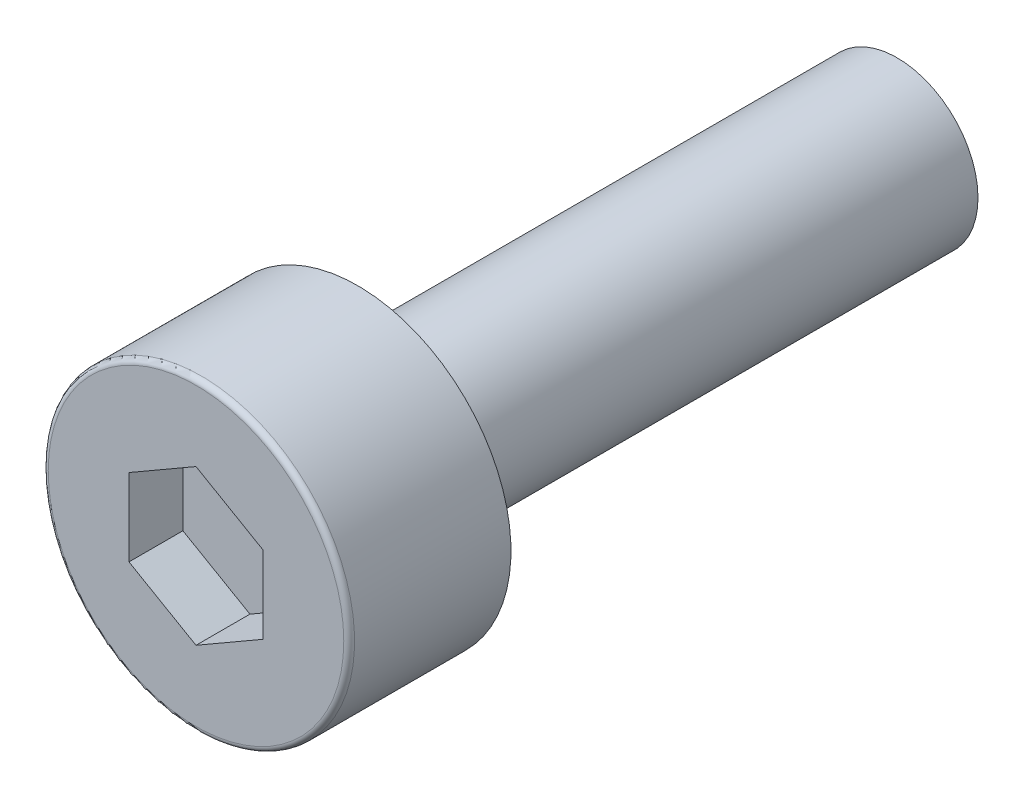
ISO-10303-21;
HEADER;
FILE_DESCRIPTION(('STEP AP214'),'2;1');
FILE_NAME('part.step','',(''),(''),'','','');
FILE_SCHEMA(('AUTOMOTIVE_DESIGN { 1 0 10303 214 1 1 1 1 }'));
ENDSEC;
DATA;
#1=APPLICATION_CONTEXT('core data for automotive mechanical design processes');
#2=APPLICATION_PROTOCOL_DEFINITION('international standard','automotive_design',2000,#1);
#3=PRODUCT_CONTEXT('',#1,'mechanical');
#4=PRODUCT('Part','Part','',(#3));
#5=PRODUCT_RELATED_PRODUCT_CATEGORY('part','',(#4));
#6=PRODUCT_DEFINITION_FORMATION('','',#4);
#7=PRODUCT_DEFINITION_CONTEXT('part definition',#1,'design');
#8=PRODUCT_DEFINITION('design','',#6,#7);
#9=PRODUCT_DEFINITION_SHAPE('','',#8);
#10=(LENGTH_UNIT() NAMED_UNIT(*) SI_UNIT(.MILLI.,.METRE.));
#11=(NAMED_UNIT(*) PLANE_ANGLE_UNIT() SI_UNIT($,.RADIAN.));
#12=(NAMED_UNIT(*) SI_UNIT($,.STERADIAN.) SOLID_ANGLE_UNIT());
#13=UNCERTAINTY_MEASURE_WITH_UNIT(LENGTH_MEASURE(1.E-05),#10,'distance_accuracy_value','');
#14=(GEOMETRIC_REPRESENTATION_CONTEXT(3) GLOBAL_UNCERTAINTY_ASSIGNED_CONTEXT((#13)) GLOBAL_UNIT_ASSIGNED_CONTEXT((#10,
#11,#12)) REPRESENTATION_CONTEXT('',''));
#15=CARTESIAN_POINT('',(0.,0.,0.));
#16=DIRECTION('',(0.,0.,1.));
#17=DIRECTION('',(1.,0.,0.));
#18=AXIS2_PLACEMENT_3D('',#15,#16,#17);
#19=CARTESIAN_POINT('',(0.,0.,2.));
#20=DIRECTION('',(0.,0.,1.));
#21=DIRECTION('',(1.,0.,0.));
#22=AXIS2_PLACEMENT_3D('',#19,#20,#21);
#23=PLANE('',#22);
#24=DIRECTION('',(-0.866025403784439,-0.5,0.));
#25=VECTOR('',#24,1.);
#26=CARTESIAN_POINT('',(0.,1.435,2.));
#27=LINE('',#26,#25);
#28=CARTESIAN_POINT('',(0.,1.435,2.));
#29=VERTEX_POINT('',#28);
#30=CARTESIAN_POINT('',(-1.24274645443067,0.7175,2.));
#31=VERTEX_POINT('',#30);
#32=EDGE_CURVE('E61',#29,#31,#27,.T.);
#33=ORIENTED_EDGE('',*,*,#32,.T.);
#34=DIRECTION('',(0.,-1.,0.));
#35=VECTOR('',#34,1.);
#36=CARTESIAN_POINT('',(-1.24274645443067,0.7175,2.));
#37=LINE('',#36,#35);
#38=CARTESIAN_POINT('',(-1.24274645443067,-0.7175,2.));
#39=VERTEX_POINT('',#38);
#40=EDGE_CURVE('E63',#31,#39,#37,.T.);
#41=ORIENTED_EDGE('',*,*,#40,.T.);
#42=DIRECTION('',(0.866025403784439,-0.5,0.));
#43=VECTOR('',#42,1.);
#44=CARTESIAN_POINT('',(-1.24274645443067,-0.7175,2.));
#45=LINE('',#44,#43);
#46=CARTESIAN_POINT('',(0.,-1.435,2.));
#47=VERTEX_POINT('',#46);
#48=EDGE_CURVE('E65',#39,#47,#45,.T.);
#49=ORIENTED_EDGE('',*,*,#48,.T.);
#50=DIRECTION('',(0.866025403784439,0.5,0.));
#51=VECTOR('',#50,1.);
#52=CARTESIAN_POINT('',(0.,-1.435,2.));
#53=LINE('',#52,#51);
#54=CARTESIAN_POINT('',(1.24274645443067,-0.717500000000001,2.));
#55=VERTEX_POINT('',#54);
#56=EDGE_CURVE('E134',#47,#55,#53,.T.);
#57=ORIENTED_EDGE('',*,*,#56,.T.);
#58=DIRECTION('',(0.,1.,0.));
#59=VECTOR('',#58,1.);
#60=CARTESIAN_POINT('',(1.24274645443067,-0.7175,2.));
#61=LINE('',#60,#59);
#62=CARTESIAN_POINT('',(1.24274645443067,0.7175,2.));
#63=VERTEX_POINT('',#62);
#64=EDGE_CURVE('E140',#55,#63,#61,.T.);
#65=ORIENTED_EDGE('',*,*,#64,.T.);
#66=DIRECTION('',(-0.866025403784439,0.5,0.));
#67=VECTOR('',#66,1.);
#68=CARTESIAN_POINT('',(1.24274645443067,0.717500000000001,2.));
#69=LINE('',#68,#67);
#70=EDGE_CURVE('E145',#63,#29,#69,.T.);
#71=ORIENTED_EDGE('',*,*,#70,.T.);
#72=EDGE_LOOP('',(#33,#41,#49,#57,#65,#71));
#73=FACE_BOUND('',#72,.T.);
#74=ADVANCED_FACE('F17',(#73),#23,.T.);
#75=CARTESIAN_POINT('',(-1.24274645443067,-0.7175,2.));
#76=DIRECTION('',(-0.5,-0.866025403784439,0.));
#77=DIRECTION('',(0.866025403784439,-0.5,0.));
#78=AXIS2_PLACEMENT_3D('',#75,#76,#77);
#79=PLANE('',#78);
#80=DIRECTION('',(0.,0.,1.));
#81=VECTOR('',#80,1.);
#82=CARTESIAN_POINT('',(0.,-1.435,2.));
#83=LINE('',#82,#81);
#84=CARTESIAN_POINT('',(0.,-1.435,3.));
#85=VERTEX_POINT('',#84);
#86=EDGE_CURVE('E79',#85,#47,#83,.F.);
#87=ORIENTED_EDGE('',*,*,#86,.T.);
#88=ORIENTED_EDGE('',*,*,#48,.F.);
#89=DIRECTION('',(0.,0.,1.));
#90=VECTOR('',#89,1.);
#91=CARTESIAN_POINT('',(-1.24274645443067,-0.7175,2.));
#92=LINE('',#91,#90);
#93=CARTESIAN_POINT('',(-1.24274645443067,-0.7175,3.));
#94=VERTEX_POINT('',#93);
#95=EDGE_CURVE('E71',#39,#94,#92,.T.);
#96=ORIENTED_EDGE('',*,*,#95,.T.);
#97=DIRECTION('',(-0.866025403784438,0.5,0.));
#98=VECTOR('',#97,1.);
#99=CARTESIAN_POINT('',(0.,-1.435,3.));
#100=LINE('',#99,#98);
#101=EDGE_CURVE('E133',#85,#94,#100,.T.);
#102=ORIENTED_EDGE('',*,*,#101,.F.);
#103=EDGE_LOOP('',(#87,#88,#96,#102));
#104=FACE_BOUND('',#103,.T.);
#105=ADVANCED_FACE('F75',(#104),#79,.F.);
#106=CARTESIAN_POINT('',(-1.24274645443067,0.7175,2.));
#107=DIRECTION('',(-1.,0.,0.));
#108=DIRECTION('',(0.,-1.,0.));
#109=AXIS2_PLACEMENT_3D('',#106,#107,#108);
#110=PLANE('',#109);
#111=ORIENTED_EDGE('',*,*,#95,.F.);
#112=ORIENTED_EDGE('',*,*,#40,.F.);
#113=DIRECTION('',(0.,0.,1.));
#114=VECTOR('',#113,1.);
#115=CARTESIAN_POINT('',(-1.24274645443067,0.7175,2.));
#116=LINE('',#115,#114);
#117=CARTESIAN_POINT('',(-1.24274645443067,0.7175,3.));
#118=VERTEX_POINT('',#117);
#119=EDGE_CURVE('E87',#31,#118,#116,.T.);
#120=ORIENTED_EDGE('',*,*,#119,.T.);
#121=DIRECTION('',(0.,1.,0.));
#122=VECTOR('',#121,1.);
#123=CARTESIAN_POINT('',(-1.24274645443067,0.,3.));
#124=LINE('',#123,#122);
#125=EDGE_CURVE('E84',#94,#118,#124,.T.);
#126=ORIENTED_EDGE('',*,*,#125,.F.);
#127=EDGE_LOOP('',(#111,#112,#120,#126));
#128=FACE_BOUND('',#127,.T.);
#129=ADVANCED_FACE('F82',(#128),#110,.F.);
#130=CARTESIAN_POINT('',(0.,1.435,2.));
#131=DIRECTION('',(-0.5,0.866025403784439,0.));
#132=DIRECTION('',(-0.866025403784439,-0.5,0.));
#133=AXIS2_PLACEMENT_3D('',#130,#131,#132);
#134=PLANE('',#133);
#135=ORIENTED_EDGE('',*,*,#119,.F.);
#136=ORIENTED_EDGE('',*,*,#32,.F.);
#137=DIRECTION('',(0.,0.,1.));
#138=VECTOR('',#137,1.);
#139=CARTESIAN_POINT('',(0.,1.435,2.));
#140=LINE('',#139,#138);
#141=CARTESIAN_POINT('',(0.,1.435,3.));
#142=VERTEX_POINT('',#141);
#143=EDGE_CURVE('E142',#29,#142,#140,.T.);
#144=ORIENTED_EDGE('',*,*,#143,.T.);
#145=DIRECTION('',(0.866025403784439,0.5,0.));
#146=VECTOR('',#145,1.);
#147=CARTESIAN_POINT('',(-1.24274645443067,0.7175,3.));
#148=LINE('',#147,#146);
#149=EDGE_CURVE('E152',#118,#142,#148,.T.);
#150=ORIENTED_EDGE('',*,*,#149,.F.);
#151=EDGE_LOOP('',(#135,#136,#144,#150));
#152=FACE_BOUND('',#151,.T.);
#153=ADVANCED_FACE('F153',(#152),#134,.F.);
#154=CARTESIAN_POINT('',(1.24274645443067,0.717500000000001,2.));
#155=DIRECTION('',(0.5,0.866025403784439,0.));
#156=DIRECTION('',(-0.866025403784439,0.5,0.));
#157=AXIS2_PLACEMENT_3D('',#154,#155,#156);
#158=PLANE('',#157);
#159=ORIENTED_EDGE('',*,*,#143,.F.);
#160=ORIENTED_EDGE('',*,*,#70,.F.);
#161=DIRECTION('',(0.,0.,1.));
#162=VECTOR('',#161,1.);
#163=CARTESIAN_POINT('',(1.24274645443067,0.717500000000001,2.));
#164=LINE('',#163,#162);
#165=CARTESIAN_POINT('',(1.24274645443067,0.717500000000001,3.));
#166=VERTEX_POINT('',#165);
#167=EDGE_CURVE('E137',#63,#166,#164,.T.);
#168=ORIENTED_EDGE('',*,*,#167,.T.);
#169=DIRECTION('',(0.866025403784439,-0.5,0.));
#170=VECTOR('',#169,1.);
#171=CARTESIAN_POINT('',(0.,1.435,3.));
#172=LINE('',#171,#170);
#173=EDGE_CURVE('E158',#142,#166,#172,.T.);
#174=ORIENTED_EDGE('',*,*,#173,.F.);
#175=EDGE_LOOP('',(#159,#160,#168,#174));
#176=FACE_BOUND('',#175,.T.);
#177=ADVANCED_FACE('F241',(#176),#158,.F.);
#178=CARTESIAN_POINT('',(1.24274645443067,-0.7175,2.));
#179=DIRECTION('',(1.,0.,0.));
#180=DIRECTION('',(0.,1.,0.));
#181=AXIS2_PLACEMENT_3D('',#178,#179,#180);
#182=PLANE('',#181);
#183=ORIENTED_EDGE('',*,*,#167,.F.);
#184=ORIENTED_EDGE('',*,*,#64,.F.);
#185=DIRECTION('',(0.,0.,1.));
#186=VECTOR('',#185,1.);
#187=CARTESIAN_POINT('',(1.24274645443067,-0.717500000000001,2.));
#188=LINE('',#187,#186);
#189=CARTESIAN_POINT('',(1.24274645443067,-0.717500000000001,3.));
#190=VERTEX_POINT('',#189);
#191=EDGE_CURVE('E125',#55,#190,#188,.T.);
#192=ORIENTED_EDGE('',*,*,#191,.T.);
#193=DIRECTION('',(0.,1.,0.));
#194=VECTOR('',#193,1.);
#195=CARTESIAN_POINT('',(1.24274645443067,0.,3.));
#196=LINE('',#195,#194);
#197=EDGE_CURVE('E166',#166,#190,#196,.F.);
#198=ORIENTED_EDGE('',*,*,#197,.F.);
#199=EDGE_LOOP('',(#183,#184,#192,#198));
#200=FACE_BOUND('',#199,.T.);
#201=ADVANCED_FACE('F191',(#200),#182,.F.);
#202=CARTESIAN_POINT('',(0.,-1.435,2.));
#203=DIRECTION('',(0.5,-0.866025403784439,0.));
#204=DIRECTION('',(0.866025403784439,0.5,0.));
#205=AXIS2_PLACEMENT_3D('',#202,#203,#204);
#206=PLANE('',#205);
#207=ORIENTED_EDGE('',*,*,#191,.F.);
#208=ORIENTED_EDGE('',*,*,#56,.F.);
#209=ORIENTED_EDGE('',*,*,#86,.F.);
#210=DIRECTION('',(-0.866025403784439,-0.5,0.));
#211=VECTOR('',#210,1.);
#212=CARTESIAN_POINT('',(1.24274645443067,-0.7175,3.));
#213=LINE('',#212,#211);
#214=EDGE_CURVE('E168',#190,#85,#213,.T.);
#215=ORIENTED_EDGE('',*,*,#214,.F.);
#216=EDGE_LOOP('',(#207,#208,#209,#215));
#217=FACE_BOUND('',#216,.T.);
#218=ADVANCED_FACE('F186',(#217),#206,.F.);
#219=CARTESIAN_POINT('',(0.,0.,3.));
#220=DIRECTION('',(0.,0.,1.));
#221=DIRECTION('',(1.,0.,0.));
#222=AXIS2_PLACEMENT_3D('',#219,#220,#221);
#223=PLANE('',#222);
#224=ORIENTED_EDGE('',*,*,#197,.T.);
#225=ORIENTED_EDGE('',*,*,#214,.T.);
#226=ORIENTED_EDGE('',*,*,#101,.T.);
#227=ORIENTED_EDGE('',*,*,#125,.T.);
#228=ORIENTED_EDGE('',*,*,#149,.T.);
#229=ORIENTED_EDGE('',*,*,#173,.T.);
#230=EDGE_LOOP('',(#224,#225,#226,#227,#228,#229));
#231=FACE_BOUND('',#230,.T.);
#232=CARTESIAN_POINT('',(0.,0.,3.));
#233=DIRECTION('',(0.,0.,-1.));
#234=DIRECTION('',(-1.,0.,0.));
#235=AXIS2_PLACEMENT_3D('',#232,#233,#234);
#236=CIRCLE('',#235,2.74);
#237=CARTESIAN_POINT('',(-2.74,0.,3.));
#238=VERTEX_POINT('',#237);
#239=CARTESIAN_POINT('',(2.74,0.,3.));
#240=VERTEX_POINT('',#239);
#241=EDGE_CURVE('E36',#238,#240,#236,.T.);
#242=ORIENTED_EDGE('',*,*,#241,.F.);
#243=CARTESIAN_POINT('',(0.,0.,3.));
#244=DIRECTION('',(0.,0.,-1.));
#245=DIRECTION('',(1.,0.,0.));
#246=AXIS2_PLACEMENT_3D('',#243,#244,#245);
#247=CIRCLE('',#246,2.74);
#248=EDGE_CURVE('E99',#240,#238,#247,.T.);
#249=ORIENTED_EDGE('',*,*,#248,.F.);
#250=EDGE_LOOP('',(#242,#249));
#251=FACE_BOUND('',#250,.T.);
#252=ADVANCED_FACE('F113',(#231,#251),#223,.T.);
#253=CARTESIAN_POINT('',(0.,0.,2.9));
#254=DIRECTION('',(0.,0.,1.));
#255=DIRECTION('',(1.,0.,0.));
#256=AXIS2_PLACEMENT_3D('',#253,#254,#255);
#257=TOROIDAL_SURFACE('',#256,2.74,0.1);
#258=CARTESIAN_POINT('',(0.,0.,2.9));
#259=DIRECTION('',(0.,0.,-1.));
#260=DIRECTION('',(-1.,0.,0.));
#261=AXIS2_PLACEMENT_3D('',#258,#259,#260);
#262=CIRCLE('',#261,2.84);
#263=CARTESIAN_POINT('',(-2.84,0.,2.9));
#264=VERTEX_POINT('',#263);
#265=EDGE_CURVE('E95',#264,#264,#262,.T.);
#266=ORIENTED_EDGE('',*,*,#265,.F.);
#267=EDGE_LOOP('',(#266));
#268=FACE_BOUND('',#267,.T.);
#269=ORIENTED_EDGE('',*,*,#248,.T.);
#270=ORIENTED_EDGE('',*,*,#241,.T.);
#271=EDGE_LOOP('',(#269,#270));
#272=FACE_BOUND('',#271,.T.);
#273=ADVANCED_FACE('F107',(#268,#272),#257,.T.);
#274=CARTESIAN_POINT('',(0.,0.,3.));
#275=DIRECTION('',(0.,0.,-1.));
#276=DIRECTION('',(-1.,0.,0.));
#277=AXIS2_PLACEMENT_3D('',#274,#275,#276);
#278=CYLINDRICAL_SURFACE('',#277,2.84);
#279=ORIENTED_EDGE('',*,*,#265,.T.);
#280=EDGE_LOOP('',(#279));
#281=FACE_BOUND('',#280,.T.);
#282=CARTESIAN_POINT('',(0.,0.,0.));
#283=DIRECTION('',(0.,0.,-1.));
#284=DIRECTION('',(-1.,0.,0.));
#285=AXIS2_PLACEMENT_3D('',#282,#283,#284);
#286=CIRCLE('',#285,2.84);
#287=CARTESIAN_POINT('',(-2.84,0.,0.));
#288=VERTEX_POINT('',#287);
#289=EDGE_CURVE('E93',#288,#288,#286,.F.);
#290=ORIENTED_EDGE('',*,*,#289,.T.);
#291=EDGE_LOOP('',(#290));
#292=FACE_BOUND('',#291,.T.);
#293=ADVANCED_FACE('F112',(#281,#292),#278,.T.);
#294=CARTESIAN_POINT('',(0.,0.,-10.));
#295=DIRECTION('',(0.,0.,-1.));
#296=DIRECTION('',(-1.,0.,0.));
#297=AXIS2_PLACEMENT_3D('',#294,#295,#296);
#298=PLANE('',#297);
#299=CARTESIAN_POINT('',(0.,0.,-10.));
#300=DIRECTION('',(0.,0.,1.));
#301=DIRECTION('',(1.,0.,0.));
#302=AXIS2_PLACEMENT_3D('',#299,#300,#301);
#303=CIRCLE('',#302,1.5);
#304=CARTESIAN_POINT('',(1.5,0.,-10.));
#305=VERTEX_POINT('',#304);
#306=EDGE_CURVE('E28',#305,#305,#303,.T.);
#307=ORIENTED_EDGE('',*,*,#306,.F.);
#308=EDGE_LOOP('',(#307));
#309=FACE_BOUND('',#308,.T.);
#310=ADVANCED_FACE('F201',(#309),#298,.T.);
#311=CARTESIAN_POINT('',(0.,0.,0.));
#312=DIRECTION('',(0.,0.,1.));
#313=DIRECTION('',(1.,0.,0.));
#314=AXIS2_PLACEMENT_3D('',#311,#312,#313);
#315=PLANE('',#314);
#316=CARTESIAN_POINT('',(0.,0.,0.));
#317=DIRECTION('',(0.,0.,1.));
#318=DIRECTION('',(1.,0.,0.));
#319=AXIS2_PLACEMENT_3D('',#316,#317,#318);
#320=CIRCLE('',#319,1.5);
#321=CARTESIAN_POINT('',(1.5,0.,0.));
#322=VERTEX_POINT('',#321);
#323=EDGE_CURVE('E11',#322,#322,#320,.F.);
#324=ORIENTED_EDGE('',*,*,#323,.F.);
#325=EDGE_LOOP('',(#324));
#326=FACE_BOUND('',#325,.T.);
#327=ORIENTED_EDGE('',*,*,#289,.F.);
#328=EDGE_LOOP('',(#327));
#329=FACE_BOUND('',#328,.T.);
#330=ADVANCED_FACE('F195',(#326,#329),#315,.F.);
#331=CARTESIAN_POINT('',(0.,0.,-10.));
#332=DIRECTION('',(0.,0.,1.));
#333=DIRECTION('',(1.,0.,0.));
#334=AXIS2_PLACEMENT_3D('',#331,#332,#333);
#335=CYLINDRICAL_SURFACE('',#334,1.5);
#336=ORIENTED_EDGE('',*,*,#323,.T.);
#337=EDGE_LOOP('',(#336));
#338=FACE_BOUND('',#337,.T.);
#339=ORIENTED_EDGE('',*,*,#306,.T.);
#340=EDGE_LOOP('',(#339));
#341=FACE_BOUND('',#340,.T.);
#342=ADVANCED_FACE('F193',(#338,#341),#335,.T.);
#343=CLOSED_SHELL('',(#74,#105,#129,#153,#177,#201,#218,#252,#273,#293,#310,#330,#342));
#344=MANIFOLD_SOLID_BREP('B1',#343);
#345=ADVANCED_BREP_SHAPE_REPRESENTATION('',(#18,#344),#14);
#346=SHAPE_DEFINITION_REPRESENTATION(#9,#345);
ENDSEC;
END-ISO-10303-21;
